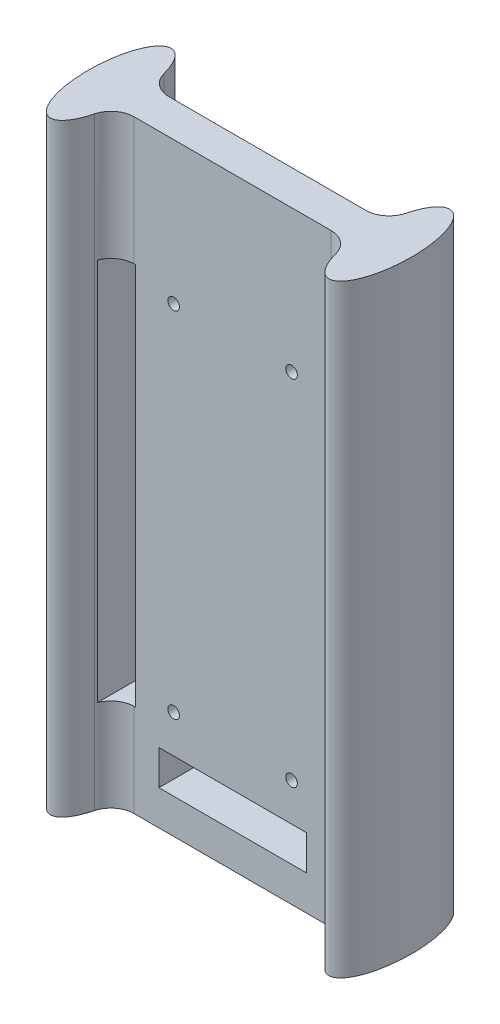
ISO-10303-21;
HEADER;
FILE_DESCRIPTION(('STEP AP214'),'2;1');
FILE_NAME('part.step','',(''),(''),'','','');
FILE_SCHEMA(('AUTOMOTIVE_DESIGN { 1 0 10303 214 1 1 1 1 }'));
ENDSEC;
DATA;
#1=APPLICATION_CONTEXT('core data for automotive mechanical design processes');
#2=APPLICATION_PROTOCOL_DEFINITION('international standard','automotive_design',2000,#1);
#3=PRODUCT_CONTEXT('',#1,'mechanical');
#4=PRODUCT('Part','Part','',(#3));
#5=PRODUCT_RELATED_PRODUCT_CATEGORY('part','',(#4));
#6=PRODUCT_DEFINITION_FORMATION('','',#4);
#7=PRODUCT_DEFINITION_CONTEXT('part definition',#1,'design');
#8=PRODUCT_DEFINITION('design','',#6,#7);
#9=PRODUCT_DEFINITION_SHAPE('','',#8);
#10=(LENGTH_UNIT() NAMED_UNIT(*) SI_UNIT(.MILLI.,.METRE.));
#11=(NAMED_UNIT(*) PLANE_ANGLE_UNIT() SI_UNIT($,.RADIAN.));
#12=(NAMED_UNIT(*) SI_UNIT($,.STERADIAN.) SOLID_ANGLE_UNIT());
#13=UNCERTAINTY_MEASURE_WITH_UNIT(LENGTH_MEASURE(1.E-05),#10,'distance_accuracy_value','');
#14=(GEOMETRIC_REPRESENTATION_CONTEXT(3) GLOBAL_UNCERTAINTY_ASSIGNED_CONTEXT((#13)) GLOBAL_UNIT_ASSIGNED_CONTEXT((#10,
#11,#12)) REPRESENTATION_CONTEXT('',''));
#15=CARTESIAN_POINT('',(0.,0.,0.));
#16=DIRECTION('',(0.,0.,1.));
#17=DIRECTION('',(1.,0.,0.));
#18=AXIS2_PLACEMENT_3D('',#15,#16,#17);
#19=CARTESIAN_POINT('',(0.,130.,-3.75));
#20=DIRECTION('',(0.,0.,1.));
#21=DIRECTION('',(1.,0.,0.));
#22=AXIS2_PLACEMENT_3D('',#19,#20,#21);
#23=PLANE('',#22);
#24=CARTESIAN_POINT('',(12.7,99.375,-3.75));
#25=DIRECTION('',(0.,0.,-1.));
#26=DIRECTION('',(-1.,0.,0.));
#27=AXIS2_PLACEMENT_3D('',#24,#25,#26);
#28=CIRCLE('',#27,1.24999999999999);
#29=CARTESIAN_POINT('',(11.45,99.375,-3.75));
#30=VERTEX_POINT('',#29);
#31=EDGE_CURVE('E275',#30,#30,#28,.T.);
#32=ORIENTED_EDGE('',*,*,#31,.F.);
#33=EDGE_LOOP('',(#32));
#34=FACE_BOUND('',#33,.T.);
#35=CARTESIAN_POINT('',(-12.7,99.375,-3.75));
#36=DIRECTION('',(0.,0.,-1.));
#37=DIRECTION('',(-1.,0.,0.));
#38=AXIS2_PLACEMENT_3D('',#35,#36,#37);
#39=CIRCLE('',#38,1.24999999999999);
#40=CARTESIAN_POINT('',(-13.95,99.375,-3.75));
#41=VERTEX_POINT('',#40);
#42=EDGE_CURVE('E279',#41,#41,#39,.T.);
#43=ORIENTED_EDGE('',*,*,#42,.F.);
#44=EDGE_LOOP('',(#43));
#45=FACE_BOUND('',#44,.T.);
#46=CARTESIAN_POINT('',(-12.7,23.175,-3.75));
#47=DIRECTION('',(0.,0.,-1.));
#48=DIRECTION('',(-1.,0.,0.));
#49=AXIS2_PLACEMENT_3D('',#46,#47,#48);
#50=CIRCLE('',#49,1.24999999999999);
#51=CARTESIAN_POINT('',(-13.95,23.175,-3.75));
#52=VERTEX_POINT('',#51);
#53=EDGE_CURVE('E283',#52,#52,#50,.T.);
#54=ORIENTED_EDGE('',*,*,#53,.F.);
#55=EDGE_LOOP('',(#54));
#56=FACE_BOUND('',#55,.T.);
#57=CARTESIAN_POINT('',(12.7,23.175,-3.75));
#58=DIRECTION('',(0.,0.,-1.));
#59=DIRECTION('',(-1.,0.,0.));
#60=AXIS2_PLACEMENT_3D('',#57,#58,#59);
#61=CIRCLE('',#60,1.24999999999999);
#62=CARTESIAN_POINT('',(11.45,23.175,-3.75));
#63=VERTEX_POINT('',#62);
#64=EDGE_CURVE('E287',#63,#63,#61,.T.);
#65=ORIENTED_EDGE('',*,*,#64,.F.);
#66=EDGE_LOOP('',(#65));
#67=FACE_BOUND('',#66,.T.);
#68=DIRECTION('',(0.,1.,0.));
#69=VECTOR('',#68,1.);
#70=CARTESIAN_POINT('',(-21.1972464863803,130.,-3.74999999999999));
#71=LINE('',#70,#69);
#72=CARTESIAN_POINT('',(-21.1972464863803,0.,-3.74999999999999));
#73=VERTEX_POINT('',#72);
#74=CARTESIAN_POINT('',(-21.1972464863803,20.,-3.74999999999999));
#75=VERTEX_POINT('',#74);
#76=EDGE_CURVE('E292',#73,#75,#71,.T.);
#77=ORIENTED_EDGE('',*,*,#76,.T.);
#78=DIRECTION('',(1.,0.,0.));
#79=VECTOR('',#78,1.);
#80=CARTESIAN_POINT('',(0.,20.,-3.75));
#81=LINE('',#80,#79);
#82=CARTESIAN_POINT('',(-20.875,20.,-3.74999999999999));
#83=VERTEX_POINT('',#82);
#84=EDGE_CURVE('E210',#75,#83,#81,.T.);
#85=ORIENTED_EDGE('',*,*,#84,.T.);
#86=DIRECTION('',(0.,1.,0.));
#87=VECTOR('',#86,1.);
#88=CARTESIAN_POINT('',(-20.875,130.,-3.74999999999999));
#89=LINE('',#88,#87);
#90=CARTESIAN_POINT('',(-20.875,102.55,-3.74999999999999));
#91=VERTEX_POINT('',#90);
#92=EDGE_CURVE('E214',#83,#91,#89,.T.);
#93=ORIENTED_EDGE('',*,*,#92,.T.);
#94=DIRECTION('',(1.,0.,0.));
#95=VECTOR('',#94,1.);
#96=CARTESIAN_POINT('',(0.,102.55,-3.75));
#97=LINE('',#96,#95);
#98=CARTESIAN_POINT('',(-21.1972464863803,102.55,-3.74999999999999));
#99=VERTEX_POINT('',#98);
#100=EDGE_CURVE('E196',#99,#91,#97,.T.);
#101=ORIENTED_EDGE('',*,*,#100,.F.);
#102=CARTESIAN_POINT('',(-21.1972464863803,130.,-3.74999999999999));
#103=VERTEX_POINT('',#102);
#104=EDGE_CURVE('E194',#99,#103,#71,.T.);
#105=ORIENTED_EDGE('',*,*,#104,.T.);
#106=DIRECTION('',(-1.,0.,0.));
#107=VECTOR('',#106,1.);
#108=CARTESIAN_POINT('',(0.,130.,-3.75));
#109=LINE('',#108,#107);
#110=CARTESIAN_POINT('',(21.1972464863802,130.,-3.75));
#111=VERTEX_POINT('',#110);
#112=EDGE_CURVE('E238',#111,#103,#109,.T.);
#113=ORIENTED_EDGE('',*,*,#112,.F.);
#114=DIRECTION('',(0.,1.,0.));
#115=VECTOR('',#114,1.);
#116=CARTESIAN_POINT('',(21.1972464863802,0.,-3.75));
#117=LINE('',#116,#115);
#118=CARTESIAN_POINT('',(21.1972464863802,0.,-3.75));
#119=VERTEX_POINT('',#118);
#120=EDGE_CURVE('E412',#111,#119,#117,.F.);
#121=ORIENTED_EDGE('',*,*,#120,.T.);
#122=DIRECTION('',(-1.,0.,0.));
#123=VECTOR('',#122,1.);
#124=CARTESIAN_POINT('',(0.,0.,-3.75));
#125=LINE('',#124,#123);
#126=EDGE_CURVE('E396',#119,#73,#125,.T.);
#127=ORIENTED_EDGE('',*,*,#126,.T.);
#128=EDGE_LOOP('',(#77,#85,#93,#101,#105,#113,#121,#127));
#129=FACE_BOUND('',#128,.T.);
#130=DIRECTION('',(1.,0.,0.));
#131=VECTOR('',#130,1.);
#132=CARTESIAN_POINT('',(0.,15.,-3.75));
#133=LINE('',#132,#131);
#134=CARTESIAN_POINT('',(-15.875,15.,-3.74999999999999));
#135=VERTEX_POINT('',#134);
#136=CARTESIAN_POINT('',(15.875,15.,-3.75));
#137=VERTEX_POINT('',#136);
#138=EDGE_CURVE('E229',#135,#137,#133,.T.);
#139=ORIENTED_EDGE('',*,*,#138,.F.);
#140=DIRECTION('',(0.,-1.,0.));
#141=VECTOR('',#140,1.);
#142=CARTESIAN_POINT('',(-15.875,130.,-3.74999999999999));
#143=LINE('',#142,#141);
#144=CARTESIAN_POINT('',(-15.875,7.5,-3.75));
#145=VERTEX_POINT('',#144);
#146=EDGE_CURVE('E225',#135,#145,#143,.T.);
#147=ORIENTED_EDGE('',*,*,#146,.T.);
#148=DIRECTION('',(1.,0.,0.));
#149=VECTOR('',#148,1.);
#150=CARTESIAN_POINT('',(0.,7.50000000000001,-3.75));
#151=LINE('',#150,#149);
#152=CARTESIAN_POINT('',(15.875,7.5,-3.75));
#153=VERTEX_POINT('',#152);
#154=EDGE_CURVE('E221',#145,#153,#151,.T.);
#155=ORIENTED_EDGE('',*,*,#154,.T.);
#156=DIRECTION('',(0.,-1.,0.));
#157=VECTOR('',#156,1.);
#158=CARTESIAN_POINT('',(15.875,130.,-3.75));
#159=LINE('',#158,#157);
#160=EDGE_CURVE('E218',#137,#153,#159,.T.);
#161=ORIENTED_EDGE('',*,*,#160,.F.);
#162=EDGE_LOOP('',(#139,#147,#155,#161));
#163=FACE_BOUND('',#162,.T.);
#164=ADVANCED_FACE('F41',(#34,#45,#56,#67,#129,#163),#23,.F.);
#165=CARTESIAN_POINT('',(0.,130.,3.75));
#166=DIRECTION('',(0.,0.,1.));
#167=DIRECTION('',(1.,0.,0.));
#168=AXIS2_PLACEMENT_3D('',#165,#166,#167);
#169=PLANE('',#168);
#170=CARTESIAN_POINT('',(12.7,99.375,3.75));
#171=DIRECTION('',(0.,0.,1.));
#172=DIRECTION('',(1.,0.,0.));
#173=AXIS2_PLACEMENT_3D('',#170,#171,#172);
#174=CIRCLE('',#173,1.24999999999999);
#175=CARTESIAN_POINT('',(13.95,99.375,3.75));
#176=VERTEX_POINT('',#175);
#177=EDGE_CURVE('E616',#176,#176,#174,.T.);
#178=ORIENTED_EDGE('',*,*,#177,.F.);
#179=EDGE_LOOP('',(#178));
#180=FACE_BOUND('',#179,.T.);
#181=CARTESIAN_POINT('',(-12.7,99.375,3.75));
#182=DIRECTION('',(0.,0.,1.));
#183=DIRECTION('',(1.,0.,0.));
#184=AXIS2_PLACEMENT_3D('',#181,#182,#183);
#185=CIRCLE('',#184,1.24999999999999);
#186=CARTESIAN_POINT('',(-11.45,99.375,3.75));
#187=VERTEX_POINT('',#186);
#188=EDGE_CURVE('E624',#187,#187,#185,.T.);
#189=ORIENTED_EDGE('',*,*,#188,.F.);
#190=EDGE_LOOP('',(#189));
#191=FACE_BOUND('',#190,.T.);
#192=CARTESIAN_POINT('',(-12.7,23.175,3.75));
#193=DIRECTION('',(0.,0.,1.));
#194=DIRECTION('',(1.,0.,0.));
#195=AXIS2_PLACEMENT_3D('',#192,#193,#194);
#196=CIRCLE('',#195,1.24999999999999);
#197=CARTESIAN_POINT('',(-11.45,23.175,3.75));
#198=VERTEX_POINT('',#197);
#199=EDGE_CURVE('E324',#198,#198,#196,.T.);
#200=ORIENTED_EDGE('',*,*,#199,.F.);
#201=EDGE_LOOP('',(#200));
#202=FACE_BOUND('',#201,.T.);
#203=CARTESIAN_POINT('',(12.7,23.175,3.75));
#204=DIRECTION('',(0.,0.,1.));
#205=DIRECTION('',(1.,0.,0.));
#206=AXIS2_PLACEMENT_3D('',#203,#204,#205);
#207=CIRCLE('',#206,1.24999999999999);
#208=CARTESIAN_POINT('',(13.95,23.175,3.75));
#209=VERTEX_POINT('',#208);
#210=EDGE_CURVE('E45',#209,#209,#207,.T.);
#211=ORIENTED_EDGE('',*,*,#210,.F.);
#212=EDGE_LOOP('',(#211));
#213=FACE_BOUND('',#212,.T.);
#214=DIRECTION('',(1.,0.,0.));
#215=VECTOR('',#214,1.);
#216=CARTESIAN_POINT('',(0.,20.,3.75));
#217=LINE('',#216,#215);
#218=CARTESIAN_POINT('',(-21.1972464863803,20.,3.75));
#219=VERTEX_POINT('',#218);
#220=CARTESIAN_POINT('',(-20.875,20.,3.75));
#221=VERTEX_POINT('',#220);
#222=EDGE_CURVE('E200',#219,#221,#217,.T.);
#223=ORIENTED_EDGE('',*,*,#222,.F.);
#224=DIRECTION('',(0.,-1.,0.));
#225=VECTOR('',#224,1.);
#226=CARTESIAN_POINT('',(-21.1972464863803,130.,3.75));
#227=LINE('',#226,#225);
#228=CARTESIAN_POINT('',(-21.1972464863803,0.,3.75));
#229=VERTEX_POINT('',#228);
#230=EDGE_CURVE('E425',#219,#229,#227,.T.);
#231=ORIENTED_EDGE('',*,*,#230,.T.);
#232=DIRECTION('',(-1.,0.,0.));
#233=VECTOR('',#232,1.);
#234=CARTESIAN_POINT('',(0.,0.,3.75));
#235=LINE('',#234,#233);
#236=CARTESIAN_POINT('',(21.1972464863802,0.,3.75));
#237=VERTEX_POINT('',#236);
#238=EDGE_CURVE('E239',#237,#229,#235,.T.);
#239=ORIENTED_EDGE('',*,*,#238,.F.);
#240=DIRECTION('',(0.,-1.,0.));
#241=VECTOR('',#240,1.);
#242=CARTESIAN_POINT('',(21.1972464863802,130.,3.75));
#243=LINE('',#242,#241);
#244=CARTESIAN_POINT('',(21.1972464863802,130.,3.75));
#245=VERTEX_POINT('',#244);
#246=EDGE_CURVE('E430',#237,#245,#243,.F.);
#247=ORIENTED_EDGE('',*,*,#246,.T.);
#248=DIRECTION('',(-1.,0.,0.));
#249=VECTOR('',#248,1.);
#250=CARTESIAN_POINT('',(0.,130.,3.75));
#251=LINE('',#250,#249);
#252=CARTESIAN_POINT('',(-21.1972464863803,130.,3.75));
#253=VERTEX_POINT('',#252);
#254=EDGE_CURVE('E388',#245,#253,#251,.T.);
#255=ORIENTED_EDGE('',*,*,#254,.T.);
#256=CARTESIAN_POINT('',(-21.1972464863803,102.55,3.75));
#257=VERTEX_POINT('',#256);
#258=EDGE_CURVE('E426',#253,#257,#227,.T.);
#259=ORIENTED_EDGE('',*,*,#258,.T.);
#260=DIRECTION('',(1.,0.,0.));
#261=VECTOR('',#260,1.);
#262=CARTESIAN_POINT('',(0.,102.55,3.75));
#263=LINE('',#262,#261);
#264=CARTESIAN_POINT('',(-20.875,102.55,3.75));
#265=VERTEX_POINT('',#264);
#266=EDGE_CURVE('E178',#257,#265,#263,.T.);
#267=ORIENTED_EDGE('',*,*,#266,.T.);
#268=DIRECTION('',(0.,1.,0.));
#269=VECTOR('',#268,1.);
#270=CARTESIAN_POINT('',(-20.875,130.,3.75));
#271=LINE('',#270,#269);
#272=EDGE_CURVE('E345',#221,#265,#271,.T.);
#273=ORIENTED_EDGE('',*,*,#272,.F.);
#274=EDGE_LOOP('',(#223,#231,#239,#247,#255,#259,#267,#273));
#275=FACE_BOUND('',#274,.T.);
#276=DIRECTION('',(0.,-1.,0.));
#277=VECTOR('',#276,1.);
#278=CARTESIAN_POINT('',(-15.875,130.,3.75));
#279=LINE('',#278,#277);
#280=CARTESIAN_POINT('',(-15.875,15.,3.75));
#281=VERTEX_POINT('',#280);
#282=CARTESIAN_POINT('',(-15.875,7.5,3.75));
#283=VERTEX_POINT('',#282);
#284=EDGE_CURVE('E51',#281,#283,#279,.T.);
#285=ORIENTED_EDGE('',*,*,#284,.F.);
#286=DIRECTION('',(1.,0.,0.));
#287=VECTOR('',#286,1.);
#288=CARTESIAN_POINT('',(0.,15.,3.75));
#289=LINE('',#288,#287);
#290=CARTESIAN_POINT('',(15.875,15.,3.75));
#291=VERTEX_POINT('',#290);
#292=EDGE_CURVE('E11',#281,#291,#289,.T.);
#293=ORIENTED_EDGE('',*,*,#292,.T.);
#294=DIRECTION('',(0.,-1.,0.));
#295=VECTOR('',#294,1.);
#296=CARTESIAN_POINT('',(15.875,130.,3.75));
#297=LINE('',#296,#295);
#298=CARTESIAN_POINT('',(15.875,7.50000000000001,3.75));
#299=VERTEX_POINT('',#298);
#300=EDGE_CURVE('E342',#291,#299,#297,.T.);
#301=ORIENTED_EDGE('',*,*,#300,.T.);
#302=DIRECTION('',(1.,0.,0.));
#303=VECTOR('',#302,1.);
#304=CARTESIAN_POINT('',(0.,7.50000000000001,3.75));
#305=LINE('',#304,#303);
#306=EDGE_CURVE('E338',#283,#299,#305,.T.);
#307=ORIENTED_EDGE('',*,*,#306,.F.);
#308=EDGE_LOOP('',(#285,#293,#301,#307));
#309=FACE_BOUND('',#308,.T.);
#310=ADVANCED_FACE('F247',(#180,#191,#202,#213,#275,#309),#169,.T.);
#311=CARTESIAN_POINT('',(29.9999999999999,130.,0.));
#312=DIRECTION('',(0.,1.,0.));
#313=DIRECTION('',(0.,0.,-1.));
#314=AXIS2_PLACEMENT_3D('',#311,#312,#313);
#315=ELLIPSE('',#314,13.,4.85);
#316=DIRECTION('',(0.,-1.,0.));
#317=VECTOR('',#316,1.);
#318=SURFACE_OF_LINEAR_EXTRUSION('',#315,#317);
#319=CARTESIAN_POINT('',(29.9999999999999,0.,0.));
#320=DIRECTION('',(0.,1.,0.));
#321=DIRECTION('',(0.,0.,-1.));
#322=AXIS2_PLACEMENT_3D('',#319,#320,#321);
#323=ELLIPSE('',#322,13.,4.85);
#324=CARTESIAN_POINT('',(26.0334127002702,0.,7.48055273775213));
#325=VERTEX_POINT('',#324);
#326=CARTESIAN_POINT('',(26.0334127002702,0.,-7.48055273775214));
#327=VERTEX_POINT('',#326);
#328=EDGE_CURVE('E232',#325,#327,#323,.T.);
#329=ORIENTED_EDGE('',*,*,#328,.T.);
#330=DIRECTION('',(0.,-1.,0.));
#331=VECTOR('',#330,1.);
#332=CARTESIAN_POINT('',(26.0334127002702,0.,-7.48055273775214));
#333=LINE('',#332,#331);
#334=CARTESIAN_POINT('',(26.0334127002702,130.,-7.48055273775214));
#335=VERTEX_POINT('',#334);
#336=EDGE_CURVE('E422',#327,#335,#333,.F.);
#337=ORIENTED_EDGE('',*,*,#336,.T.);
#338=CARTESIAN_POINT('',(26.0334127002702,130.,7.48055273775213));
#339=VERTEX_POINT('',#338);
#340=EDGE_CURVE('E233',#339,#335,#315,.T.);
#341=ORIENTED_EDGE('',*,*,#340,.F.);
#342=DIRECTION('',(0.,-1.,0.));
#343=VECTOR('',#342,1.);
#344=CARTESIAN_POINT('',(26.0334127002702,130.,7.48055273775213));
#345=LINE('',#344,#343);
#346=EDGE_CURVE('E418',#339,#325,#345,.T.);
#347=ORIENTED_EDGE('',*,*,#346,.T.);
#348=EDGE_LOOP('',(#329,#337,#341,#347));
#349=FACE_BOUND('',#348,.T.);
#350=ADVANCED_FACE('F242',(#349),#318,.F.);
#351=CARTESIAN_POINT('',(-30.0000000000001,130.,0.));
#352=DIRECTION('',(0.,1.,0.));
#353=DIRECTION('',(0.,0.,1.));
#354=AXIS2_PLACEMENT_3D('',#351,#352,#353);
#355=ELLIPSE('',#354,13.,4.85);
#356=DIRECTION('',(0.,-1.,0.));
#357=VECTOR('',#356,1.);
#358=SURFACE_OF_LINEAR_EXTRUSION('',#355,#357);
#359=CARTESIAN_POINT('',(-26.0334127002703,130.,-7.48055273775212));
#360=VERTEX_POINT('',#359);
#361=CARTESIAN_POINT('',(-26.0334127002703,130.,7.48055273775213));
#362=VERTEX_POINT('',#361);
#363=EDGE_CURVE('E383',#360,#362,#355,.T.);
#364=ORIENTED_EDGE('',*,*,#363,.F.);
#365=DIRECTION('',(0.,-1.,0.));
#366=VECTOR('',#365,1.);
#367=CARTESIAN_POINT('',(-26.0334127002703,130.,-7.48055273775212));
#368=LINE('',#367,#366);
#369=CARTESIAN_POINT('',(-26.0334127002703,0.,-7.48055273775212));
#370=VERTEX_POINT('',#369);
#371=EDGE_CURVE('E408',#360,#370,#368,.T.);
#372=ORIENTED_EDGE('',*,*,#371,.T.);
#373=CARTESIAN_POINT('',(-30.0000000000001,0.,0.));
#374=DIRECTION('',(0.,1.,0.));
#375=DIRECTION('',(0.,0.,1.));
#376=AXIS2_PLACEMENT_3D('',#373,#374,#375);
#377=ELLIPSE('',#376,13.,4.85);
#378=CARTESIAN_POINT('',(-26.0334127002703,0.,7.48055273775213));
#379=VERTEX_POINT('',#378);
#380=EDGE_CURVE('E399',#370,#379,#377,.T.);
#381=ORIENTED_EDGE('',*,*,#380,.T.);
#382=DIRECTION('',(0.,-1.,0.));
#383=VECTOR('',#382,1.);
#384=CARTESIAN_POINT('',(-26.0334127002703,0.,7.48055273775213));
#385=LINE('',#384,#383);
#386=EDGE_CURVE('E392',#379,#362,#385,.F.);
#387=ORIENTED_EDGE('',*,*,#386,.T.);
#388=EDGE_LOOP('',(#364,#372,#381,#387));
#389=FACE_BOUND('',#388,.T.);
#390=ADVANCED_FACE('F246',(#389),#358,.F.);
#391=CARTESIAN_POINT('',(0.,130.,0.));
#392=DIRECTION('',(0.,1.,0.));
#393=DIRECTION('',(0.,0.,1.));
#394=AXIS2_PLACEMENT_3D('',#391,#392,#393);
#395=PLANE('',#394);
#396=ORIENTED_EDGE('',*,*,#254,.F.);
#397=CARTESIAN_POINT('',(21.1972464863802,130.,8.75));
#398=DIRECTION('',(0.,1.,0.));
#399=DIRECTION('',(0.,0.,1.));
#400=AXIS2_PLACEMENT_3D('',#397,#398,#399);
#401=CIRCLE('',#400,5.);
#402=EDGE_CURVE('E448',#245,#339,#401,.F.);
#403=ORIENTED_EDGE('',*,*,#402,.T.);
#404=ORIENTED_EDGE('',*,*,#340,.T.);
#405=CARTESIAN_POINT('',(21.1972464863802,130.,-8.75));
#406=DIRECTION('',(0.,1.,0.));
#407=DIRECTION('',(0.,0.,1.));
#408=AXIS2_PLACEMENT_3D('',#405,#406,#407);
#409=CIRCLE('',#408,5.);
#410=EDGE_CURVE('E442',#335,#111,#409,.F.);
#411=ORIENTED_EDGE('',*,*,#410,.T.);
#412=ORIENTED_EDGE('',*,*,#112,.T.);
#413=CARTESIAN_POINT('',(-21.1972464863803,130.,-8.74999999999999));
#414=DIRECTION('',(0.,1.,0.));
#415=DIRECTION('',(0.,0.,1.));
#416=AXIS2_PLACEMENT_3D('',#413,#414,#415);
#417=CIRCLE('',#416,5.);
#418=EDGE_CURVE('E436',#103,#360,#417,.F.);
#419=ORIENTED_EDGE('',*,*,#418,.T.);
#420=ORIENTED_EDGE('',*,*,#363,.T.);
#421=CARTESIAN_POINT('',(-21.1972464863803,130.,8.75));
#422=DIRECTION('',(0.,1.,0.));
#423=DIRECTION('',(0.,0.,1.));
#424=AXIS2_PLACEMENT_3D('',#421,#422,#423);
#425=CIRCLE('',#424,5.);
#426=EDGE_CURVE('E454',#362,#253,#425,.F.);
#427=ORIENTED_EDGE('',*,*,#426,.T.);
#428=EDGE_LOOP('',(#396,#403,#404,#411,#412,#419,#420,#427));
#429=FACE_BOUND('',#428,.T.);
#430=ADVANCED_FACE('F375',(#429),#395,.T.);
#431=CARTESIAN_POINT('',(0.,0.,0.));
#432=DIRECTION('',(0.,1.,0.));
#433=DIRECTION('',(0.,0.,1.));
#434=AXIS2_PLACEMENT_3D('',#431,#432,#433);
#435=PLANE('',#434);
#436=ORIENTED_EDGE('',*,*,#328,.F.);
#437=CARTESIAN_POINT('',(21.1972464863802,0.,8.75));
#438=DIRECTION('',(0.,1.,0.));
#439=DIRECTION('',(0.,0.,1.));
#440=AXIS2_PLACEMENT_3D('',#437,#438,#439);
#441=CIRCLE('',#440,5.);
#442=EDGE_CURVE('E445',#325,#237,#441,.T.);
#443=ORIENTED_EDGE('',*,*,#442,.T.);
#444=ORIENTED_EDGE('',*,*,#238,.T.);
#445=CARTESIAN_POINT('',(-21.1972464863803,0.,8.75));
#446=DIRECTION('',(0.,1.,0.));
#447=DIRECTION('',(0.,0.,1.));
#448=AXIS2_PLACEMENT_3D('',#445,#446,#447);
#449=CIRCLE('',#448,5.);
#450=EDGE_CURVE('E451',#229,#379,#449,.T.);
#451=ORIENTED_EDGE('',*,*,#450,.T.);
#452=ORIENTED_EDGE('',*,*,#380,.F.);
#453=CARTESIAN_POINT('',(-21.1972464863803,0.,-8.74999999999999));
#454=DIRECTION('',(0.,1.,0.));
#455=DIRECTION('',(0.,0.,1.));
#456=AXIS2_PLACEMENT_3D('',#453,#454,#455);
#457=CIRCLE('',#456,5.);
#458=EDGE_CURVE('E433',#370,#73,#457,.T.);
#459=ORIENTED_EDGE('',*,*,#458,.T.);
#460=ORIENTED_EDGE('',*,*,#126,.F.);
#461=CARTESIAN_POINT('',(21.1972464863802,0.,-8.75));
#462=DIRECTION('',(0.,1.,0.));
#463=DIRECTION('',(0.,0.,1.));
#464=AXIS2_PLACEMENT_3D('',#461,#462,#463);
#465=CIRCLE('',#464,5.);
#466=EDGE_CURVE('E439',#119,#327,#465,.T.);
#467=ORIENTED_EDGE('',*,*,#466,.T.);
#468=EDGE_LOOP('',(#436,#443,#444,#451,#452,#459,#460,#467));
#469=FACE_BOUND('',#468,.T.);
#470=ADVANCED_FACE('F253',(#469),#435,.F.);
#471=CARTESIAN_POINT('',(-21.1972464863803,65.,-8.74999999999999));
#472=DIRECTION('',(0.,-1.,0.));
#473=DIRECTION('',(0.,0.,-1.));
#474=AXIS2_PLACEMENT_3D('',#471,#472,#473);
#475=CYLINDRICAL_SURFACE('',#474,5.);
#476=DIRECTION('',(0.,-1.,0.));
#477=VECTOR('',#476,1.);
#478=CARTESIAN_POINT('',(-25.875,65.,-6.98403792061706));
#479=LINE('',#478,#477);
#480=CARTESIAN_POINT('',(-25.875,20.,-6.98403792061706));
#481=VERTEX_POINT('',#480);
#482=CARTESIAN_POINT('',(-25.875,102.55,-6.98403792061706));
#483=VERTEX_POINT('',#482);
#484=EDGE_CURVE('E166',#481,#483,#479,.F.);
#485=ORIENTED_EDGE('',*,*,#484,.F.);
#486=CARTESIAN_POINT('',(-21.1972464863803,20.,-8.74999999999999));
#487=DIRECTION('',(0.,-1.,0.));
#488=DIRECTION('',(0.,0.,-1.));
#489=AXIS2_PLACEMENT_3D('',#486,#487,#488);
#490=CIRCLE('',#489,5.);
#491=EDGE_CURVE('E207',#481,#75,#490,.F.);
#492=ORIENTED_EDGE('',*,*,#491,.T.);
#493=ORIENTED_EDGE('',*,*,#76,.F.);
#494=ORIENTED_EDGE('',*,*,#458,.F.);
#495=ORIENTED_EDGE('',*,*,#371,.F.);
#496=ORIENTED_EDGE('',*,*,#418,.F.);
#497=ORIENTED_EDGE('',*,*,#104,.F.);
#498=CARTESIAN_POINT('',(-21.1972464863803,102.55,-8.74999999999999));
#499=DIRECTION('',(0.,-1.,0.));
#500=DIRECTION('',(0.,0.,-1.));
#501=AXIS2_PLACEMENT_3D('',#498,#499,#500);
#502=CIRCLE('',#501,5.);
#503=EDGE_CURVE('E183',#483,#99,#502,.F.);
#504=ORIENTED_EDGE('',*,*,#503,.F.);
#505=EDGE_LOOP('',(#485,#492,#493,#494,#495,#496,#497,#504));
#506=FACE_BOUND('',#505,.T.);
#507=ADVANCED_FACE('F192',(#506),#475,.F.);
#508=CARTESIAN_POINT('',(21.1972464863802,65.,-8.75));
#509=DIRECTION('',(0.,-1.,0.));
#510=DIRECTION('',(0.,0.,-1.));
#511=AXIS2_PLACEMENT_3D('',#508,#509,#510);
#512=CYLINDRICAL_SURFACE('',#511,5.);
#513=ORIENTED_EDGE('',*,*,#410,.F.);
#514=ORIENTED_EDGE('',*,*,#336,.F.);
#515=ORIENTED_EDGE('',*,*,#466,.F.);
#516=ORIENTED_EDGE('',*,*,#120,.F.);
#517=EDGE_LOOP('',(#513,#514,#515,#516));
#518=FACE_BOUND('',#517,.T.);
#519=ADVANCED_FACE('F252',(#518),#512,.F.);
#520=CARTESIAN_POINT('',(21.1972464863802,65.,8.75));
#521=DIRECTION('',(0.,-1.,0.));
#522=DIRECTION('',(0.,0.,-1.));
#523=AXIS2_PLACEMENT_3D('',#520,#521,#522);
#524=CYLINDRICAL_SURFACE('',#523,5.);
#525=ORIENTED_EDGE('',*,*,#402,.F.);
#526=ORIENTED_EDGE('',*,*,#246,.F.);
#527=ORIENTED_EDGE('',*,*,#442,.F.);
#528=ORIENTED_EDGE('',*,*,#346,.F.);
#529=EDGE_LOOP('',(#525,#526,#527,#528));
#530=FACE_BOUND('',#529,.T.);
#531=ADVANCED_FACE('F255',(#530),#524,.F.);
#532=CARTESIAN_POINT('',(-21.1972464863803,65.,8.75));
#533=DIRECTION('',(0.,-1.,0.));
#534=DIRECTION('',(0.,0.,-1.));
#535=AXIS2_PLACEMENT_3D('',#532,#533,#534);
#536=CYLINDRICAL_SURFACE('',#535,5.);
#537=ORIENTED_EDGE('',*,*,#230,.F.);
#538=CARTESIAN_POINT('',(-21.1972464863803,20.,8.75));
#539=DIRECTION('',(0.,-1.,0.));
#540=DIRECTION('',(0.,0.,-1.));
#541=AXIS2_PLACEMENT_3D('',#538,#539,#540);
#542=CIRCLE('',#541,5.);
#543=CARTESIAN_POINT('',(-25.875,20.,6.98403792061707));
#544=VERTEX_POINT('',#543);
#545=EDGE_CURVE('E348',#219,#544,#542,.F.);
#546=ORIENTED_EDGE('',*,*,#545,.T.);
#547=DIRECTION('',(0.,-1.,0.));
#548=VECTOR('',#547,1.);
#549=CARTESIAN_POINT('',(-25.875,65.,6.98403792061707));
#550=LINE('',#549,#548);
#551=CARTESIAN_POINT('',(-25.875,102.55,6.98403792061707));
#552=VERTEX_POINT('',#551);
#553=EDGE_CURVE('E457',#552,#544,#550,.T.);
#554=ORIENTED_EDGE('',*,*,#553,.F.);
#555=CARTESIAN_POINT('',(-21.1972464863803,102.55,8.75));
#556=DIRECTION('',(0.,-1.,0.));
#557=DIRECTION('',(0.,0.,-1.));
#558=AXIS2_PLACEMENT_3D('',#555,#556,#557);
#559=CIRCLE('',#558,5.);
#560=EDGE_CURVE('E186',#257,#552,#559,.F.);
#561=ORIENTED_EDGE('',*,*,#560,.F.);
#562=ORIENTED_EDGE('',*,*,#258,.F.);
#563=ORIENTED_EDGE('',*,*,#426,.F.);
#564=ORIENTED_EDGE('',*,*,#386,.F.);
#565=ORIENTED_EDGE('',*,*,#450,.F.);
#566=EDGE_LOOP('',(#537,#546,#554,#561,#562,#563,#564,#565));
#567=FACE_BOUND('',#566,.T.);
#568=ADVANCED_FACE('F43',(#567),#536,.F.);
#569=CARTESIAN_POINT('',(-20.875,102.55,13.));
#570=DIRECTION('',(1.,0.,0.));
#571=DIRECTION('',(0.,0.,-1.));
#572=AXIS2_PLACEMENT_3D('',#569,#570,#571);
#573=PLANE('',#572);
#574=DIRECTION('',(0.,0.,-1.));
#575=VECTOR('',#574,1.);
#576=CARTESIAN_POINT('',(-20.875,20.,13.));
#577=LINE('',#576,#575);
#578=EDGE_CURVE('E314',#221,#83,#577,.T.);
#579=ORIENTED_EDGE('',*,*,#578,.F.);
#580=ORIENTED_EDGE('',*,*,#272,.T.);
#581=DIRECTION('',(0.,0.,-1.));
#582=VECTOR('',#581,1.);
#583=CARTESIAN_POINT('',(-20.875,102.55,13.));
#584=LINE('',#583,#582);
#585=EDGE_CURVE('E189',#265,#91,#584,.T.);
#586=ORIENTED_EDGE('',*,*,#585,.T.);
#587=ORIENTED_EDGE('',*,*,#92,.F.);
#588=EDGE_LOOP('',(#579,#580,#586,#587));
#589=FACE_BOUND('',#588,.T.);
#590=ADVANCED_FACE('F262',(#589),#573,.F.);
#591=CARTESIAN_POINT('',(-20.875,20.,13.));
#592=DIRECTION('',(0.,-1.,0.));
#593=DIRECTION('',(0.,0.,-1.));
#594=AXIS2_PLACEMENT_3D('',#591,#592,#593);
#595=PLANE('',#594);
#596=ORIENTED_EDGE('',*,*,#491,.F.);
#597=DIRECTION('',(0.,0.,-1.));
#598=VECTOR('',#597,1.);
#599=CARTESIAN_POINT('',(-25.875,20.,13.));
#600=LINE('',#599,#598);
#601=EDGE_CURVE('E172',#544,#481,#600,.T.);
#602=ORIENTED_EDGE('',*,*,#601,.F.);
#603=ORIENTED_EDGE('',*,*,#545,.F.);
#604=ORIENTED_EDGE('',*,*,#222,.T.);
#605=ORIENTED_EDGE('',*,*,#578,.T.);
#606=ORIENTED_EDGE('',*,*,#84,.F.);
#607=EDGE_LOOP('',(#596,#602,#603,#604,#605,#606));
#608=FACE_BOUND('',#607,.T.);
#609=ADVANCED_FACE('F365',(#608),#595,.F.);
#610=CARTESIAN_POINT('',(-20.875,102.55,13.));
#611=DIRECTION('',(0.,-1.,0.));
#612=DIRECTION('',(0.,0.,-1.));
#613=AXIS2_PLACEMENT_3D('',#610,#611,#612);
#614=PLANE('',#613);
#615=ORIENTED_EDGE('',*,*,#100,.T.);
#616=ORIENTED_EDGE('',*,*,#585,.F.);
#617=ORIENTED_EDGE('',*,*,#266,.F.);
#618=ORIENTED_EDGE('',*,*,#560,.T.);
#619=DIRECTION('',(0.,0.,-1.));
#620=VECTOR('',#619,1.);
#621=CARTESIAN_POINT('',(-25.875,102.55,13.));
#622=LINE('',#621,#620);
#623=EDGE_CURVE('E169',#552,#483,#622,.T.);
#624=ORIENTED_EDGE('',*,*,#623,.T.);
#625=ORIENTED_EDGE('',*,*,#503,.T.);
#626=EDGE_LOOP('',(#615,#616,#617,#618,#624,#625));
#627=FACE_BOUND('',#626,.T.);
#628=ADVANCED_FACE('F182',(#627),#614,.T.);
#629=CARTESIAN_POINT('',(-25.875,102.55,13.));
#630=DIRECTION('',(1.,0.,0.));
#631=DIRECTION('',(0.,0.,-1.));
#632=AXIS2_PLACEMENT_3D('',#629,#630,#631);
#633=PLANE('',#632);
#634=ORIENTED_EDGE('',*,*,#484,.T.);
#635=ORIENTED_EDGE('',*,*,#623,.F.);
#636=ORIENTED_EDGE('',*,*,#553,.T.);
#637=ORIENTED_EDGE('',*,*,#601,.T.);
#638=EDGE_LOOP('',(#634,#635,#636,#637));
#639=FACE_BOUND('',#638,.T.);
#640=ADVANCED_FACE('F168',(#639),#633,.T.);
#641=CARTESIAN_POINT('',(15.875,15.,13.));
#642=DIRECTION('',(0.,-1.,0.));
#643=DIRECTION('',(0.,0.,-1.));
#644=AXIS2_PLACEMENT_3D('',#641,#642,#643);
#645=PLANE('',#644);
#646=ORIENTED_EDGE('',*,*,#138,.T.);
#647=DIRECTION('',(0.,0.,-1.));
#648=VECTOR('',#647,1.);
#649=CARTESIAN_POINT('',(15.875,15.,13.));
#650=LINE('',#649,#648);
#651=EDGE_CURVE('E58',#291,#137,#650,.T.);
#652=ORIENTED_EDGE('',*,*,#651,.F.);
#653=ORIENTED_EDGE('',*,*,#292,.F.);
#654=DIRECTION('',(0.,0.,-1.));
#655=VECTOR('',#654,1.);
#656=CARTESIAN_POINT('',(-15.875,15.,13.));
#657=LINE('',#656,#655);
#658=EDGE_CURVE('E179',#281,#135,#657,.T.);
#659=ORIENTED_EDGE('',*,*,#658,.T.);
#660=EDGE_LOOP('',(#646,#652,#653,#659));
#661=FACE_BOUND('',#660,.T.);
#662=ADVANCED_FACE('F297',(#661),#645,.T.);
#663=CARTESIAN_POINT('',(-15.875,7.5,13.));
#664=DIRECTION('',(-1.,0.,0.));
#665=DIRECTION('',(0.,0.,1.));
#666=AXIS2_PLACEMENT_3D('',#663,#664,#665);
#667=PLANE('',#666);
#668=ORIENTED_EDGE('',*,*,#658,.F.);
#669=ORIENTED_EDGE('',*,*,#284,.T.);
#670=DIRECTION('',(0.,0.,-1.));
#671=VECTOR('',#670,1.);
#672=CARTESIAN_POINT('',(-15.875,7.5,13.));
#673=LINE('',#672,#671);
#674=EDGE_CURVE('E302',#283,#145,#673,.T.);
#675=ORIENTED_EDGE('',*,*,#674,.T.);
#676=ORIENTED_EDGE('',*,*,#146,.F.);
#677=EDGE_LOOP('',(#668,#669,#675,#676));
#678=FACE_BOUND('',#677,.T.);
#679=ADVANCED_FACE('F353',(#678),#667,.F.);
#680=CARTESIAN_POINT('',(15.875,7.5,13.));
#681=DIRECTION('',(0.,-1.,0.));
#682=DIRECTION('',(0.,0.,-1.));
#683=AXIS2_PLACEMENT_3D('',#680,#681,#682);
#684=PLANE('',#683);
#685=ORIENTED_EDGE('',*,*,#674,.F.);
#686=ORIENTED_EDGE('',*,*,#306,.T.);
#687=DIRECTION('',(0.,0.,-1.));
#688=VECTOR('',#687,1.);
#689=CARTESIAN_POINT('',(15.875,7.5,13.));
#690=LINE('',#689,#688);
#691=EDGE_CURVE('E63',#299,#153,#690,.T.);
#692=ORIENTED_EDGE('',*,*,#691,.T.);
#693=ORIENTED_EDGE('',*,*,#154,.F.);
#694=EDGE_LOOP('',(#685,#686,#692,#693));
#695=FACE_BOUND('',#694,.T.);
#696=ADVANCED_FACE('F336',(#695),#684,.F.);
#697=CARTESIAN_POINT('',(15.875,7.5,13.));
#698=DIRECTION('',(-1.,0.,0.));
#699=DIRECTION('',(0.,0.,1.));
#700=AXIS2_PLACEMENT_3D('',#697,#698,#699);
#701=PLANE('',#700);
#702=ORIENTED_EDGE('',*,*,#160,.T.);
#703=ORIENTED_EDGE('',*,*,#691,.F.);
#704=ORIENTED_EDGE('',*,*,#300,.F.);
#705=ORIENTED_EDGE('',*,*,#651,.T.);
#706=EDGE_LOOP('',(#702,#703,#704,#705));
#707=FACE_BOUND('',#706,.T.);
#708=ADVANCED_FACE('F360',(#707),#701,.T.);
#709=CARTESIAN_POINT('',(12.7,23.175,-3.75));
#710=DIRECTION('',(0.,0.,-1.));
#711=DIRECTION('',(-1.,0.,0.));
#712=AXIS2_PLACEMENT_3D('',#709,#710,#711);
#713=CYLINDRICAL_SURFACE('',#712,1.24999999999999);
#714=ORIENTED_EDGE('',*,*,#210,.T.);
#715=EDGE_LOOP('',(#714));
#716=FACE_BOUND('',#715,.T.);
#717=ORIENTED_EDGE('',*,*,#64,.T.);
#718=EDGE_LOOP('',(#717));
#719=FACE_BOUND('',#718,.T.);
#720=ADVANCED_FACE('F573',(#716,#719),#713,.F.);
#721=CARTESIAN_POINT('',(-12.7,23.175,-3.74999999999999));
#722=DIRECTION('',(0.,0.,-1.));
#723=DIRECTION('',(-1.,0.,0.));
#724=AXIS2_PLACEMENT_3D('',#721,#722,#723);
#725=CYLINDRICAL_SURFACE('',#724,1.24999999999999);
#726=ORIENTED_EDGE('',*,*,#199,.T.);
#727=EDGE_LOOP('',(#726));
#728=FACE_BOUND('',#727,.T.);
#729=ORIENTED_EDGE('',*,*,#53,.T.);
#730=EDGE_LOOP('',(#729));
#731=FACE_BOUND('',#730,.T.);
#732=ADVANCED_FACE('F579',(#728,#731),#725,.F.);
#733=CARTESIAN_POINT('',(-12.7,99.375,-3.74999999999999));
#734=DIRECTION('',(0.,0.,-1.));
#735=DIRECTION('',(-1.,0.,0.));
#736=AXIS2_PLACEMENT_3D('',#733,#734,#735);
#737=CYLINDRICAL_SURFACE('',#736,1.24999999999999);
#738=ORIENTED_EDGE('',*,*,#188,.T.);
#739=EDGE_LOOP('',(#738));
#740=FACE_BOUND('',#739,.T.);
#741=ORIENTED_EDGE('',*,*,#42,.T.);
#742=EDGE_LOOP('',(#741));
#743=FACE_BOUND('',#742,.T.);
#744=ADVANCED_FACE('F587',(#740,#743),#737,.F.);
#745=CARTESIAN_POINT('',(12.7,99.375,-3.75));
#746=DIRECTION('',(0.,0.,-1.));
#747=DIRECTION('',(-1.,0.,0.));
#748=AXIS2_PLACEMENT_3D('',#745,#746,#747);
#749=CYLINDRICAL_SURFACE('',#748,1.24999999999999);
#750=ORIENTED_EDGE('',*,*,#177,.T.);
#751=EDGE_LOOP('',(#750));
#752=FACE_BOUND('',#751,.T.);
#753=ORIENTED_EDGE('',*,*,#31,.T.);
#754=EDGE_LOOP('',(#753));
#755=FACE_BOUND('',#754,.T.);
#756=ADVANCED_FACE('F596',(#752,#755),#749,.F.);
#757=CLOSED_SHELL('',(#164,#310,#350,#390,#430,#470,#507,#519,#531,#568,#590,#609,#628,#640,
#662,#679,#696,#708,#720,#732,#744,#756));
#758=MANIFOLD_SOLID_BREP('B2',#757);
#759=ADVANCED_BREP_SHAPE_REPRESENTATION('',(#18,#758),#14);
#760=SHAPE_DEFINITION_REPRESENTATION(#9,#759);
ENDSEC;
END-ISO-10303-21;
